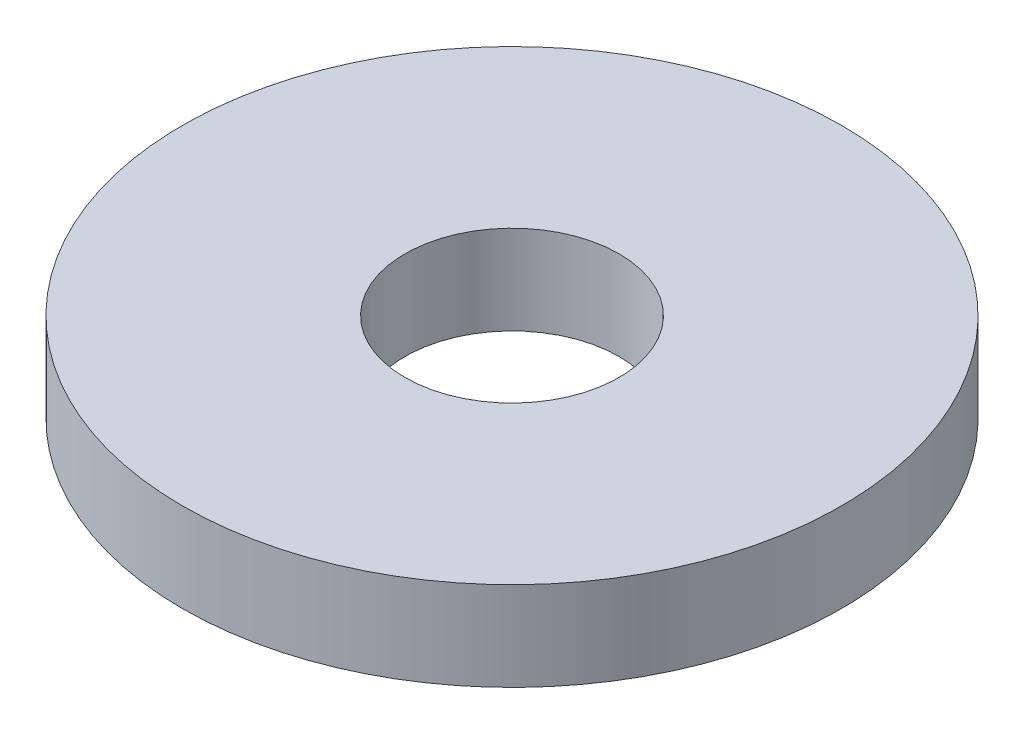
ISO-10303-21;
HEADER;
FILE_DESCRIPTION(('STEP AP214'),'2;1');
FILE_NAME('part.step','',(''),(''),'','','');
FILE_SCHEMA(('AUTOMOTIVE_DESIGN { 1 0 10303 214 1 1 1 1 }'));
ENDSEC;
DATA;
#1=APPLICATION_CONTEXT('core data for automotive mechanical design processes');
#2=APPLICATION_PROTOCOL_DEFINITION('international standard','automotive_design',2000,#1);
#3=PRODUCT_CONTEXT('',#1,'mechanical');
#4=PRODUCT('Part','Part','',(#3));
#5=PRODUCT_RELATED_PRODUCT_CATEGORY('part','',(#4));
#6=PRODUCT_DEFINITION_FORMATION('','',#4);
#7=PRODUCT_DEFINITION_CONTEXT('part definition',#1,'design');
#8=PRODUCT_DEFINITION('design','',#6,#7);
#9=PRODUCT_DEFINITION_SHAPE('','',#8);
#10=(LENGTH_UNIT() NAMED_UNIT(*) SI_UNIT(.MILLI.,.METRE.));
#11=(NAMED_UNIT(*) PLANE_ANGLE_UNIT() SI_UNIT($,.RADIAN.));
#12=(NAMED_UNIT(*) SI_UNIT($,.STERADIAN.) SOLID_ANGLE_UNIT());
#13=UNCERTAINTY_MEASURE_WITH_UNIT(LENGTH_MEASURE(1.E-05),#10,'distance_accuracy_value','');
#14=(GEOMETRIC_REPRESENTATION_CONTEXT(3) GLOBAL_UNCERTAINTY_ASSIGNED_CONTEXT((#13)) GLOBAL_UNIT_ASSIGNED_CONTEXT((#10,
#11,#12)) REPRESENTATION_CONTEXT('',''));
#15=CARTESIAN_POINT('',(0.,0.,0.));
#16=DIRECTION('',(0.,0.,1.));
#17=DIRECTION('',(1.,0.,0.));
#18=AXIS2_PLACEMENT_3D('',#15,#16,#17);
#19=CARTESIAN_POINT('',(0.,27.,0.));
#20=DIRECTION('',(0.,-1.,0.));
#21=DIRECTION('',(0.,0.,-1.));
#22=AXIS2_PLACEMENT_3D('',#19,#20,#21);
#23=CYLINDRICAL_SURFACE('',#22,100.);
#24=CARTESIAN_POINT('',(0.,27.,0.));
#25=DIRECTION('',(0.,1.,0.));
#26=DIRECTION('',(0.,0.,1.));
#27=AXIS2_PLACEMENT_3D('',#24,#25,#26);
#28=CIRCLE('',#27,100.);
#29=CARTESIAN_POINT('',(0.,27.,100.));
#30=VERTEX_POINT('',#29);
#31=EDGE_CURVE('E10',#30,#30,#28,.T.);
#32=ORIENTED_EDGE('',*,*,#31,.F.);
#33=EDGE_LOOP('',(#32));
#34=FACE_BOUND('',#33,.T.);
#35=CARTESIAN_POINT('',(0.,0.,0.));
#36=DIRECTION('',(0.,1.,0.));
#37=DIRECTION('',(0.,0.,1.));
#38=AXIS2_PLACEMENT_3D('',#35,#36,#37);
#39=CIRCLE('',#38,100.);
#40=CARTESIAN_POINT('',(0.,0.,100.));
#41=VERTEX_POINT('',#40);
#42=EDGE_CURVE('E37',#41,#41,#39,.T.);
#43=ORIENTED_EDGE('',*,*,#42,.T.);
#44=EDGE_LOOP('',(#43));
#45=FACE_BOUND('',#44,.T.);
#46=ADVANCED_FACE('F40',(#34,#45),#23,.T.);
#47=CARTESIAN_POINT('',(0.,27.,0.));
#48=DIRECTION('',(0.,1.,0.));
#49=DIRECTION('',(0.,0.,1.));
#50=AXIS2_PLACEMENT_3D('',#47,#48,#49);
#51=PLANE('',#50);
#52=CARTESIAN_POINT('',(0.,27.,0.));
#53=DIRECTION('',(0.,1.,0.));
#54=DIRECTION('',(0.,0.,1.));
#55=AXIS2_PLACEMENT_3D('',#52,#53,#54);
#56=CIRCLE('',#55,32.5);
#57=CARTESIAN_POINT('',(0.,27.,32.5));
#58=VERTEX_POINT('',#57);
#59=EDGE_CURVE('E50',#58,#58,#56,.T.);
#60=ORIENTED_EDGE('',*,*,#59,.F.);
#61=EDGE_LOOP('',(#60));
#62=FACE_BOUND('',#61,.T.);
#63=ORIENTED_EDGE('',*,*,#31,.T.);
#64=EDGE_LOOP('',(#63));
#65=FACE_BOUND('',#64,.T.);
#66=ADVANCED_FACE('F59',(#62,#65),#51,.T.);
#67=CARTESIAN_POINT('',(0.,0.,0.));
#68=DIRECTION('',(0.,1.,0.));
#69=DIRECTION('',(0.,0.,1.));
#70=AXIS2_PLACEMENT_3D('',#67,#68,#69);
#71=PLANE('',#70);
#72=CARTESIAN_POINT('',(0.,0.,0.));
#73=DIRECTION('',(0.,1.,0.));
#74=DIRECTION('',(0.,0.,1.));
#75=AXIS2_PLACEMENT_3D('',#72,#73,#74);
#76=CIRCLE('',#75,32.5);
#77=CARTESIAN_POINT('',(0.,0.,32.5));
#78=VERTEX_POINT('',#77);
#79=EDGE_CURVE('E47',#78,#78,#76,.T.);
#80=ORIENTED_EDGE('',*,*,#79,.T.);
#81=EDGE_LOOP('',(#80));
#82=FACE_BOUND('',#81,.T.);
#83=ORIENTED_EDGE('',*,*,#42,.F.);
#84=EDGE_LOOP('',(#83));
#85=FACE_BOUND('',#84,.T.);
#86=ADVANCED_FACE('F58',(#82,#85),#71,.F.);
#87=CARTESIAN_POINT('',(0.,27.,0.));
#88=DIRECTION('',(0.,-1.,0.));
#89=DIRECTION('',(0.,0.,-1.));
#90=AXIS2_PLACEMENT_3D('',#87,#88,#89);
#91=CYLINDRICAL_SURFACE('',#90,32.5);
#92=ORIENTED_EDGE('',*,*,#59,.T.);
#93=EDGE_LOOP('',(#92));
#94=FACE_BOUND('',#93,.T.);
#95=ORIENTED_EDGE('',*,*,#79,.F.);
#96=EDGE_LOOP('',(#95));
#97=FACE_BOUND('',#96,.T.);
#98=ADVANCED_FACE('F54',(#94,#97),#91,.F.);
#99=CLOSED_SHELL('',(#46,#66,#86,#98));
#100=MANIFOLD_SOLID_BREP('B2',#99);
#101=ADVANCED_BREP_SHAPE_REPRESENTATION('',(#18,#100),#14);
#102=SHAPE_DEFINITION_REPRESENTATION(#9,#101);
ENDSEC;
END-ISO-10303-21;
